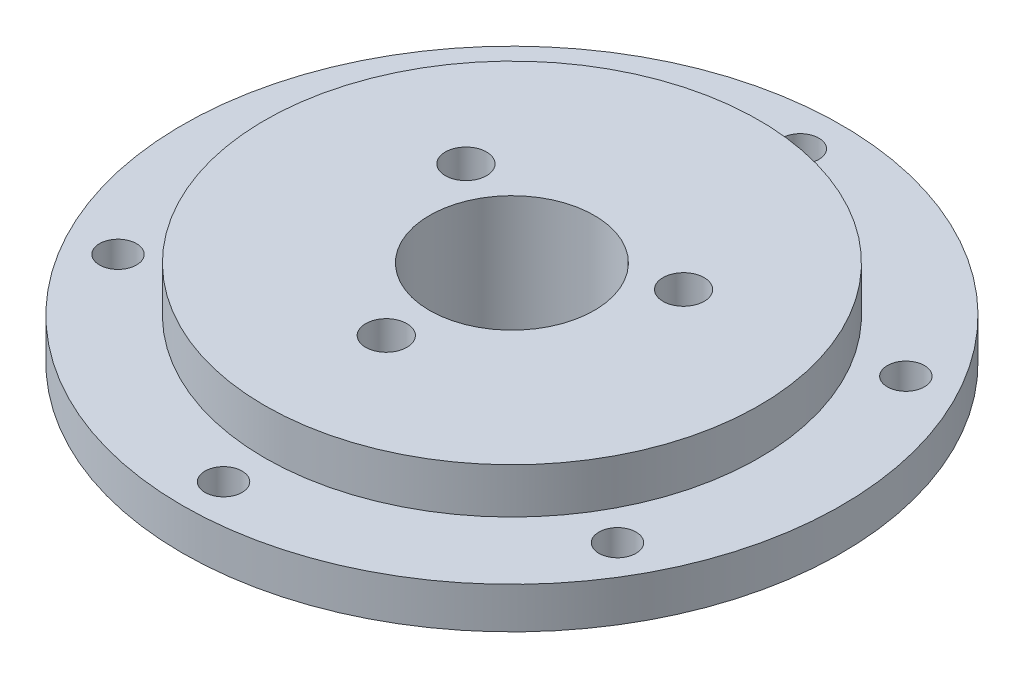
ISO-10303-21;
HEADER;
FILE_DESCRIPTION(('STEP AP214'),'2;1');
FILE_NAME('part.step','',(''),(''),'','','');
FILE_SCHEMA(('AUTOMOTIVE_DESIGN { 1 0 10303 214 1 1 1 1 }'));
ENDSEC;
DATA;
#1=APPLICATION_CONTEXT('core data for automotive mechanical design processes');
#2=APPLICATION_PROTOCOL_DEFINITION('international standard','automotive_design',2000,#1);
#3=PRODUCT_CONTEXT('',#1,'mechanical');
#4=PRODUCT('Part','Part','',(#3));
#5=PRODUCT_RELATED_PRODUCT_CATEGORY('part','',(#4));
#6=PRODUCT_DEFINITION_FORMATION('','',#4);
#7=PRODUCT_DEFINITION_CONTEXT('part definition',#1,'design');
#8=PRODUCT_DEFINITION('design','',#6,#7);
#9=PRODUCT_DEFINITION_SHAPE('','',#8);
#10=(LENGTH_UNIT() NAMED_UNIT(*) SI_UNIT(.MILLI.,.METRE.));
#11=(NAMED_UNIT(*) PLANE_ANGLE_UNIT() SI_UNIT($,.RADIAN.));
#12=(NAMED_UNIT(*) SI_UNIT($,.STERADIAN.) SOLID_ANGLE_UNIT());
#13=UNCERTAINTY_MEASURE_WITH_UNIT(LENGTH_MEASURE(1.E-05),#10,'distance_accuracy_value','');
#14=(GEOMETRIC_REPRESENTATION_CONTEXT(3) GLOBAL_UNCERTAINTY_ASSIGNED_CONTEXT((#13)) GLOBAL_UNIT_ASSIGNED_CONTEXT((#10,
#11,#12)) REPRESENTATION_CONTEXT('',''));
#15=CARTESIAN_POINT('',(0.,0.,0.));
#16=DIRECTION('',(0.,0.,1.));
#17=DIRECTION('',(1.,0.,0.));
#18=AXIS2_PLACEMENT_3D('',#15,#16,#17);
#19=CARTESIAN_POINT('',(0.,5.,0.));
#20=DIRECTION('',(0.,1.,0.));
#21=DIRECTION('',(0.,0.,1.));
#22=AXIS2_PLACEMENT_3D('',#19,#20,#21);
#23=PLANE('',#22);
#24=CARTESIAN_POINT('',(0.,5.,0.));
#25=DIRECTION('',(0.,1.,0.));
#26=DIRECTION('',(0.,0.,1.));
#27=AXIS2_PLACEMENT_3D('',#24,#25,#26);
#28=CIRCLE('',#27,30.);
#29=CARTESIAN_POINT('',(0.,5.,30.));
#30=VERTEX_POINT('',#29);
#31=EDGE_CURVE('E11',#30,#30,#28,.T.);
#32=ORIENTED_EDGE('',*,*,#31,.F.);
#33=EDGE_LOOP('',(#32));
#34=FACE_BOUND('',#33,.T.);
#35=CARTESIAN_POINT('',(-30.3108891324555,5.,17.4999999999997));
#36=DIRECTION('',(0.,1.,0.));
#37=DIRECTION('',(0.,0.,1.));
#38=AXIS2_PLACEMENT_3D('',#35,#36,#37);
#39=CIRCLE('',#38,2.25);
#40=CARTESIAN_POINT('',(-30.3108891324555,5.,19.7499999999997));
#41=VERTEX_POINT('',#40);
#42=EDGE_CURVE('E58',#41,#41,#39,.T.);
#43=ORIENTED_EDGE('',*,*,#42,.F.);
#44=EDGE_LOOP('',(#43));
#45=FACE_BOUND('',#44,.T.);
#46=CARTESIAN_POINT('',(30.3108891324553,5.,17.5000000000001));
#47=DIRECTION('',(0.,1.,0.));
#48=DIRECTION('',(0.,0.,1.));
#49=AXIS2_PLACEMENT_3D('',#46,#47,#48);
#50=CIRCLE('',#49,2.25);
#51=CARTESIAN_POINT('',(30.3108891324553,5.,19.7500000000001));
#52=VERTEX_POINT('',#51);
#53=EDGE_CURVE('E70',#52,#52,#50,.T.);
#54=ORIENTED_EDGE('',*,*,#53,.F.);
#55=EDGE_LOOP('',(#54));
#56=FACE_BOUND('',#55,.T.);
#57=CARTESIAN_POINT('',(0.,5.,-35.));
#58=DIRECTION('',(0.,1.,0.));
#59=DIRECTION('',(0.,0.,1.));
#60=AXIS2_PLACEMENT_3D('',#57,#58,#59);
#61=CIRCLE('',#60,2.25);
#62=CARTESIAN_POINT('',(0.,5.,-32.75));
#63=VERTEX_POINT('',#62);
#64=EDGE_CURVE('E82',#63,#63,#61,.T.);
#65=ORIENTED_EDGE('',*,*,#64,.F.);
#66=EDGE_LOOP('',(#65));
#67=FACE_BOUND('',#66,.T.);
#68=CARTESIAN_POINT('',(0.,5.,0.));
#69=DIRECTION('',(0.,1.,0.));
#70=DIRECTION('',(0.,0.,1.));
#71=AXIS2_PLACEMENT_3D('',#68,#69,#70);
#72=CIRCLE('',#71,40.);
#73=CARTESIAN_POINT('',(0.,5.,40.));
#74=VERTEX_POINT('',#73);
#75=EDGE_CURVE('E40',#74,#74,#72,.T.);
#76=ORIENTED_EDGE('',*,*,#75,.T.);
#77=EDGE_LOOP('',(#76));
#78=FACE_BOUND('',#77,.T.);
#79=CARTESIAN_POINT('',(30.3108891324554,5.,-17.4999999999999));
#80=DIRECTION('',(0.,1.,0.));
#81=DIRECTION('',(0.,0.,1.));
#82=AXIS2_PLACEMENT_3D('',#79,#80,#81);
#83=CIRCLE('',#82,2.25);
#84=CARTESIAN_POINT('',(30.3108891324554,5.,-15.2499999999999));
#85=VERTEX_POINT('',#84);
#86=EDGE_CURVE('E76',#85,#85,#83,.T.);
#87=ORIENTED_EDGE('',*,*,#86,.F.);
#88=EDGE_LOOP('',(#87));
#89=FACE_BOUND('',#88,.T.);
#90=CARTESIAN_POINT('',(-2.44403693719019E-13,5.,35.));
#91=DIRECTION('',(0.,1.,0.));
#92=DIRECTION('',(0.,0.,1.));
#93=AXIS2_PLACEMENT_3D('',#90,#91,#92);
#94=CIRCLE('',#93,2.25);
#95=CARTESIAN_POINT('',(-2.44403693719019E-13,5.,37.25));
#96=VERTEX_POINT('',#95);
#97=EDGE_CURVE('E64',#96,#96,#94,.T.);
#98=ORIENTED_EDGE('',*,*,#97,.F.);
#99=EDGE_LOOP('',(#98));
#100=FACE_BOUND('',#99,.T.);
#101=CARTESIAN_POINT('',(-30.3108891324552,5.,-17.5000000000004));
#102=DIRECTION('',(0.,1.,0.));
#103=DIRECTION('',(0.,0.,1.));
#104=AXIS2_PLACEMENT_3D('',#101,#102,#103);
#105=CIRCLE('',#104,2.25);
#106=CARTESIAN_POINT('',(-30.3108891324552,5.,-15.2500000000004));
#107=VERTEX_POINT('',#106);
#108=EDGE_CURVE('E51',#107,#107,#105,.T.);
#109=ORIENTED_EDGE('',*,*,#108,.F.);
#110=EDGE_LOOP('',(#109));
#111=FACE_BOUND('',#110,.T.);
#112=ADVANCED_FACE('F32',(#34,#45,#56,#67,#78,#89,#100,#111),#23,.T.);
#113=CARTESIAN_POINT('',(0.,0.,0.));
#114=DIRECTION('',(0.,1.,0.));
#115=DIRECTION('',(0.,0.,1.));
#116=AXIS2_PLACEMENT_3D('',#113,#114,#115);
#117=PLANE('',#116);
#118=CARTESIAN_POINT('',(0.,0.,0.));
#119=DIRECTION('',(0.,1.,0.));
#120=DIRECTION('',(0.,0.,1.));
#121=AXIS2_PLACEMENT_3D('',#118,#119,#120);
#122=CIRCLE('',#121,30.);
#123=CARTESIAN_POINT('',(0.,0.,30.));
#124=VERTEX_POINT('',#123);
#125=EDGE_CURVE('E36',#124,#124,#122,.T.);
#126=ORIENTED_EDGE('',*,*,#125,.T.);
#127=EDGE_LOOP('',(#126));
#128=FACE_BOUND('',#127,.T.);
#129=CARTESIAN_POINT('',(0.,0.,0.));
#130=DIRECTION('',(0.,1.,0.));
#131=DIRECTION('',(0.,0.,1.));
#132=AXIS2_PLACEMENT_3D('',#129,#130,#131);
#133=CIRCLE('',#132,40.);
#134=CARTESIAN_POINT('',(0.,0.,40.));
#135=VERTEX_POINT('',#134);
#136=EDGE_CURVE('E45',#135,#135,#133,.T.);
#137=ORIENTED_EDGE('',*,*,#136,.F.);
#138=EDGE_LOOP('',(#137));
#139=FACE_BOUND('',#138,.T.);
#140=CARTESIAN_POINT('',(0.,0.,-35.));
#141=DIRECTION('',(0.,1.,0.));
#142=DIRECTION('',(0.,0.,1.));
#143=AXIS2_PLACEMENT_3D('',#140,#141,#142);
#144=CIRCLE('',#143,2.25);
#145=CARTESIAN_POINT('',(0.,0.,-32.75));
#146=VERTEX_POINT('',#145);
#147=EDGE_CURVE('E79',#146,#146,#144,.T.);
#148=ORIENTED_EDGE('',*,*,#147,.T.);
#149=EDGE_LOOP('',(#148));
#150=FACE_BOUND('',#149,.T.);
#151=CARTESIAN_POINT('',(30.3108891324554,0.,-17.4999999999999));
#152=DIRECTION('',(0.,1.,0.));
#153=DIRECTION('',(0.,0.,1.));
#154=AXIS2_PLACEMENT_3D('',#151,#152,#153);
#155=CIRCLE('',#154,2.25);
#156=CARTESIAN_POINT('',(30.3108891324554,0.,-15.2499999999999));
#157=VERTEX_POINT('',#156);
#158=EDGE_CURVE('E73',#157,#157,#155,.T.);
#159=ORIENTED_EDGE('',*,*,#158,.T.);
#160=EDGE_LOOP('',(#159));
#161=FACE_BOUND('',#160,.T.);
#162=CARTESIAN_POINT('',(30.3108891324553,0.,17.5000000000001));
#163=DIRECTION('',(0.,1.,0.));
#164=DIRECTION('',(0.,0.,1.));
#165=AXIS2_PLACEMENT_3D('',#162,#163,#164);
#166=CIRCLE('',#165,2.25);
#167=CARTESIAN_POINT('',(30.3108891324553,0.,19.7500000000001));
#168=VERTEX_POINT('',#167);
#169=EDGE_CURVE('E67',#168,#168,#166,.T.);
#170=ORIENTED_EDGE('',*,*,#169,.T.);
#171=EDGE_LOOP('',(#170));
#172=FACE_BOUND('',#171,.T.);
#173=CARTESIAN_POINT('',(-2.44403693719019E-13,0.,35.));
#174=DIRECTION('',(0.,1.,0.));
#175=DIRECTION('',(0.,0.,1.));
#176=AXIS2_PLACEMENT_3D('',#173,#174,#175);
#177=CIRCLE('',#176,2.25);
#178=CARTESIAN_POINT('',(-2.44403693719019E-13,0.,37.25));
#179=VERTEX_POINT('',#178);
#180=EDGE_CURVE('E61',#179,#179,#177,.T.);
#181=ORIENTED_EDGE('',*,*,#180,.T.);
#182=EDGE_LOOP('',(#181));
#183=FACE_BOUND('',#182,.T.);
#184=CARTESIAN_POINT('',(-30.3108891324555,0.,17.4999999999997));
#185=DIRECTION('',(0.,1.,0.));
#186=DIRECTION('',(0.,0.,1.));
#187=AXIS2_PLACEMENT_3D('',#184,#185,#186);
#188=CIRCLE('',#187,2.25);
#189=CARTESIAN_POINT('',(-30.3108891324555,0.,19.7499999999997));
#190=VERTEX_POINT('',#189);
#191=EDGE_CURVE('E54',#190,#190,#188,.T.);
#192=ORIENTED_EDGE('',*,*,#191,.T.);
#193=EDGE_LOOP('',(#192));
#194=FACE_BOUND('',#193,.T.);
#195=CARTESIAN_POINT('',(-30.3108891324552,0.,-17.5000000000004));
#196=DIRECTION('',(0.,1.,0.));
#197=DIRECTION('',(0.,0.,1.));
#198=AXIS2_PLACEMENT_3D('',#195,#196,#197);
#199=CIRCLE('',#198,2.25);
#200=CARTESIAN_POINT('',(-30.3108891324552,0.,-15.2500000000004));
#201=VERTEX_POINT('',#200);
#202=EDGE_CURVE('E55',#201,#201,#199,.T.);
#203=ORIENTED_EDGE('',*,*,#202,.T.);
#204=EDGE_LOOP('',(#203));
#205=FACE_BOUND('',#204,.T.);
#206=ADVANCED_FACE('F90',(#128,#139,#150,#161,#172,#183,#194,#205),#117,.F.);
#207=CARTESIAN_POINT('',(0.,5.,0.));
#208=DIRECTION('',(0.,-1.,0.));
#209=DIRECTION('',(0.,0.,-1.));
#210=AXIS2_PLACEMENT_3D('',#207,#208,#209);
#211=CYLINDRICAL_SURFACE('',#210,40.);
#212=ORIENTED_EDGE('',*,*,#75,.F.);
#213=EDGE_LOOP('',(#212));
#214=FACE_BOUND('',#213,.T.);
#215=ORIENTED_EDGE('',*,*,#136,.T.);
#216=EDGE_LOOP('',(#215));
#217=FACE_BOUND('',#216,.T.);
#218=ADVANCED_FACE('F34',(#214,#217),#211,.T.);
#219=CARTESIAN_POINT('',(0.,5.,-35.));
#220=DIRECTION('',(0.,-1.,0.));
#221=DIRECTION('',(0.,0.,-1.));
#222=AXIS2_PLACEMENT_3D('',#219,#220,#221);
#223=CYLINDRICAL_SURFACE('',#222,2.25);
#224=ORIENTED_EDGE('',*,*,#64,.T.);
#225=EDGE_LOOP('',(#224));
#226=FACE_BOUND('',#225,.T.);
#227=ORIENTED_EDGE('',*,*,#147,.F.);
#228=EDGE_LOOP('',(#227));
#229=FACE_BOUND('',#228,.T.);
#230=ADVANCED_FACE('F130',(#226,#229),#223,.F.);
#231=CARTESIAN_POINT('',(30.3108891324554,5.,-17.4999999999999));
#232=DIRECTION('',(0.,-1.,0.));
#233=DIRECTION('',(0.,0.,-1.));
#234=AXIS2_PLACEMENT_3D('',#231,#232,#233);
#235=CYLINDRICAL_SURFACE('',#234,2.25);
#236=ORIENTED_EDGE('',*,*,#86,.T.);
#237=EDGE_LOOP('',(#236));
#238=FACE_BOUND('',#237,.T.);
#239=ORIENTED_EDGE('',*,*,#158,.F.);
#240=EDGE_LOOP('',(#239));
#241=FACE_BOUND('',#240,.T.);
#242=ADVANCED_FACE('F133',(#238,#241),#235,.F.);
#243=CARTESIAN_POINT('',(30.3108891324553,5.,17.5000000000001));
#244=DIRECTION('',(0.,-1.,0.));
#245=DIRECTION('',(0.,0.,-1.));
#246=AXIS2_PLACEMENT_3D('',#243,#244,#245);
#247=CYLINDRICAL_SURFACE('',#246,2.25);
#248=ORIENTED_EDGE('',*,*,#53,.T.);
#249=EDGE_LOOP('',(#248));
#250=FACE_BOUND('',#249,.T.);
#251=ORIENTED_EDGE('',*,*,#169,.F.);
#252=EDGE_LOOP('',(#251));
#253=FACE_BOUND('',#252,.T.);
#254=ADVANCED_FACE('F137',(#250,#253),#247,.F.);
#255=CARTESIAN_POINT('',(-2.44403693719019E-13,5.,35.));
#256=DIRECTION('',(0.,-1.,0.));
#257=DIRECTION('',(0.,0.,-1.));
#258=AXIS2_PLACEMENT_3D('',#255,#256,#257);
#259=CYLINDRICAL_SURFACE('',#258,2.25);
#260=ORIENTED_EDGE('',*,*,#97,.T.);
#261=EDGE_LOOP('',(#260));
#262=FACE_BOUND('',#261,.T.);
#263=ORIENTED_EDGE('',*,*,#180,.F.);
#264=EDGE_LOOP('',(#263));
#265=FACE_BOUND('',#264,.T.);
#266=ADVANCED_FACE('F119',(#262,#265),#259,.F.);
#267=CARTESIAN_POINT('',(-30.3108891324555,5.,17.4999999999997));
#268=DIRECTION('',(0.,-1.,0.));
#269=DIRECTION('',(0.,0.,-1.));
#270=AXIS2_PLACEMENT_3D('',#267,#268,#269);
#271=CYLINDRICAL_SURFACE('',#270,2.25);
#272=ORIENTED_EDGE('',*,*,#42,.T.);
#273=EDGE_LOOP('',(#272));
#274=FACE_BOUND('',#273,.T.);
#275=ORIENTED_EDGE('',*,*,#191,.F.);
#276=EDGE_LOOP('',(#275));
#277=FACE_BOUND('',#276,.T.);
#278=ADVANCED_FACE('F109',(#274,#277),#271,.F.);
#279=CARTESIAN_POINT('',(-30.3108891324552,5.,-17.5000000000004));
#280=DIRECTION('',(0.,-1.,0.));
#281=DIRECTION('',(0.,0.,-1.));
#282=AXIS2_PLACEMENT_3D('',#279,#280,#281);
#283=CYLINDRICAL_SURFACE('',#282,2.25);
#284=ORIENTED_EDGE('',*,*,#108,.T.);
#285=EDGE_LOOP('',(#284));
#286=FACE_BOUND('',#285,.T.);
#287=ORIENTED_EDGE('',*,*,#202,.F.);
#288=EDGE_LOOP('',(#287));
#289=FACE_BOUND('',#288,.T.);
#290=ADVANCED_FACE('F106',(#286,#289),#283,.F.);
#291=CARTESIAN_POINT('',(0.,-95.8528137423857,0.));
#292=DIRECTION('',(0.,1.,0.));
#293=DIRECTION('',(0.,0.,1.));
#294=AXIS2_PLACEMENT_3D('',#291,#292,#293);
#295=CYLINDRICAL_SURFACE('',#294,10.);
#296=CARTESIAN_POINT('',(0.,-5.50000000000001,0.));
#297=DIRECTION('',(0.,1.,0.));
#298=DIRECTION('',(0.,0.,1.));
#299=AXIS2_PLACEMENT_3D('',#296,#297,#298);
#300=CIRCLE('',#299,10.);
#301=CARTESIAN_POINT('',(0.,-5.50000000000001,10.));
#302=VERTEX_POINT('',#301);
#303=EDGE_CURVE('E280',#302,#302,#300,.F.);
#304=ORIENTED_EDGE('',*,*,#303,.T.);
#305=EDGE_LOOP('',(#304));
#306=FACE_BOUND('',#305,.T.);
#307=CARTESIAN_POINT('',(0.,10.5,0.));
#308=DIRECTION('',(0.,1.,0.));
#309=DIRECTION('',(0.,0.,1.));
#310=AXIS2_PLACEMENT_3D('',#307,#308,#309);
#311=CIRCLE('',#310,10.);
#312=CARTESIAN_POINT('',(0.,10.5,10.));
#313=VERTEX_POINT('',#312);
#314=EDGE_CURVE('E270',#313,#313,#311,.T.);
#315=ORIENTED_EDGE('',*,*,#314,.T.);
#316=EDGE_LOOP('',(#315));
#317=FACE_BOUND('',#316,.T.);
#318=ADVANCED_FACE('F108',(#306,#317),#295,.F.);
#319=CARTESIAN_POINT('',(-13.2068874077127,-95.8528137423857,-7.625));
#320=DIRECTION('',(0.,1.,0.));
#321=DIRECTION('',(0.,0.,1.));
#322=AXIS2_PLACEMENT_3D('',#319,#320,#321);
#323=CYLINDRICAL_SURFACE('',#322,2.5);
#324=CARTESIAN_POINT('',(-13.2068874077127,-5.50000000000001,-7.625));
#325=DIRECTION('',(0.,1.,0.));
#326=DIRECTION('',(0.,0.,1.));
#327=AXIS2_PLACEMENT_3D('',#324,#325,#326);
#328=CIRCLE('',#327,2.5);
#329=CARTESIAN_POINT('',(-13.2068874077127,-5.50000000000001,-5.125));
#330=VERTEX_POINT('',#329);
#331=EDGE_CURVE('E277',#330,#330,#328,.F.);
#332=ORIENTED_EDGE('',*,*,#331,.T.);
#333=EDGE_LOOP('',(#332));
#334=FACE_BOUND('',#333,.T.);
#335=CARTESIAN_POINT('',(-13.2068874077127,10.5,-7.625));
#336=DIRECTION('',(0.,1.,0.));
#337=DIRECTION('',(0.,0.,1.));
#338=AXIS2_PLACEMENT_3D('',#335,#336,#337);
#339=CIRCLE('',#338,2.5);
#340=CARTESIAN_POINT('',(-13.2068874077127,10.5,-5.125));
#341=VERTEX_POINT('',#340);
#342=EDGE_CURVE('E262',#341,#341,#339,.T.);
#343=ORIENTED_EDGE('',*,*,#342,.T.);
#344=EDGE_LOOP('',(#343));
#345=FACE_BOUND('',#344,.T.);
#346=ADVANCED_FACE('F116',(#334,#345),#323,.F.);
#347=CARTESIAN_POINT('',(0.,-95.8528137423857,15.25));
#348=DIRECTION('',(0.,1.,0.));
#349=DIRECTION('',(0.,0.,1.));
#350=AXIS2_PLACEMENT_3D('',#347,#348,#349);
#351=CYLINDRICAL_SURFACE('',#350,2.5);
#352=CARTESIAN_POINT('',(0.,-5.50000000000001,15.25));
#353=DIRECTION('',(0.,1.,0.));
#354=DIRECTION('',(0.,0.,1.));
#355=AXIS2_PLACEMENT_3D('',#352,#353,#354);
#356=CIRCLE('',#355,2.5);
#357=CARTESIAN_POINT('',(0.,-5.50000000000001,17.75));
#358=VERTEX_POINT('',#357);
#359=EDGE_CURVE('E281',#358,#358,#356,.F.);
#360=ORIENTED_EDGE('',*,*,#359,.T.);
#361=EDGE_LOOP('',(#360));
#362=FACE_BOUND('',#361,.T.);
#363=CARTESIAN_POINT('',(0.,10.5,15.25));
#364=DIRECTION('',(0.,1.,0.));
#365=DIRECTION('',(0.,0.,1.));
#366=AXIS2_PLACEMENT_3D('',#363,#364,#365);
#367=CIRCLE('',#366,2.5);
#368=CARTESIAN_POINT('',(0.,10.5,17.75));
#369=VERTEX_POINT('',#368);
#370=EDGE_CURVE('E265',#369,#369,#367,.T.);
#371=ORIENTED_EDGE('',*,*,#370,.T.);
#372=EDGE_LOOP('',(#371));
#373=FACE_BOUND('',#372,.T.);
#374=ADVANCED_FACE('F185',(#362,#373),#351,.F.);
#375=CARTESIAN_POINT('',(0.,-95.8528137423857,0.));
#376=DIRECTION('',(0.,1.,0.));
#377=DIRECTION('',(0.,0.,1.));
#378=AXIS2_PLACEMENT_3D('',#375,#376,#377);
#379=CYLINDRICAL_SURFACE('',#378,30.);
#380=CARTESIAN_POINT('',(0.,-5.50000000000001,0.));
#381=DIRECTION('',(0.,1.,0.));
#382=DIRECTION('',(0.,0.,1.));
#383=AXIS2_PLACEMENT_3D('',#380,#381,#382);
#384=CIRCLE('',#383,30.);
#385=CARTESIAN_POINT('',(0.,-5.50000000000001,30.));
#386=VERTEX_POINT('',#385);
#387=EDGE_CURVE('E276',#386,#386,#384,.F.);
#388=ORIENTED_EDGE('',*,*,#387,.F.);
#389=EDGE_LOOP('',(#388));
#390=FACE_BOUND('',#389,.T.);
#391=ORIENTED_EDGE('',*,*,#125,.F.);
#392=EDGE_LOOP('',(#391));
#393=FACE_BOUND('',#392,.T.);
#394=ADVANCED_FACE('F179',(#390,#393),#379,.T.);
#395=CARTESIAN_POINT('',(0.,-5.5,0.));
#396=DIRECTION('',(0.,1.,0.));
#397=DIRECTION('',(0.,0.,1.));
#398=AXIS2_PLACEMENT_3D('',#395,#396,#397);
#399=PLANE('',#398);
#400=ORIENTED_EDGE('',*,*,#387,.T.);
#401=EDGE_LOOP('',(#400));
#402=FACE_BOUND('',#401,.T.);
#403=ORIENTED_EDGE('',*,*,#359,.F.);
#404=EDGE_LOOP('',(#403));
#405=FACE_BOUND('',#404,.T.);
#406=CARTESIAN_POINT('',(13.2068874077127,-5.50000000000001,-7.62500000000001));
#407=DIRECTION('',(0.,1.,0.));
#408=DIRECTION('',(0.,0.,1.));
#409=AXIS2_PLACEMENT_3D('',#406,#407,#408);
#410=CIRCLE('',#409,2.5);
#411=CARTESIAN_POINT('',(13.2068874077127,-5.50000000000001,-5.125));
#412=VERTEX_POINT('',#411);
#413=EDGE_CURVE('E49',#412,#412,#410,.F.);
#414=ORIENTED_EDGE('',*,*,#413,.F.);
#415=EDGE_LOOP('',(#414));
#416=FACE_BOUND('',#415,.T.);
#417=ORIENTED_EDGE('',*,*,#331,.F.);
#418=EDGE_LOOP('',(#417));
#419=FACE_BOUND('',#418,.T.);
#420=ORIENTED_EDGE('',*,*,#303,.F.);
#421=EDGE_LOOP('',(#420));
#422=FACE_BOUND('',#421,.T.);
#423=ADVANCED_FACE('F184',(#402,#405,#416,#419,#422),#399,.F.);
#424=CARTESIAN_POINT('',(13.2068874077127,-95.8528137423857,-7.62500000000001));
#425=DIRECTION('',(0.,1.,0.));
#426=DIRECTION('',(0.,0.,1.));
#427=AXIS2_PLACEMENT_3D('',#424,#425,#426);
#428=CYLINDRICAL_SURFACE('',#427,2.5);
#429=ORIENTED_EDGE('',*,*,#413,.T.);
#430=EDGE_LOOP('',(#429));
#431=FACE_BOUND('',#430,.T.);
#432=CARTESIAN_POINT('',(13.2068874077127,10.5,-7.62500000000001));
#433=DIRECTION('',(0.,1.,0.));
#434=DIRECTION('',(0.,0.,1.));
#435=AXIS2_PLACEMENT_3D('',#432,#433,#434);
#436=CIRCLE('',#435,2.5);
#437=CARTESIAN_POINT('',(13.2068874077127,10.5,-5.125));
#438=VERTEX_POINT('',#437);
#439=EDGE_CURVE('E260',#438,#438,#436,.T.);
#440=ORIENTED_EDGE('',*,*,#439,.T.);
#441=EDGE_LOOP('',(#440));
#442=FACE_BOUND('',#441,.T.);
#443=ADVANCED_FACE('F197',(#431,#442),#428,.F.);
#444=ORIENTED_EDGE('',*,*,#31,.T.);
#445=EDGE_LOOP('',(#444));
#446=FACE_BOUND('',#445,.T.);
#447=CARTESIAN_POINT('',(0.,10.5,0.));
#448=DIRECTION('',(0.,1.,0.));
#449=DIRECTION('',(0.,0.,1.));
#450=AXIS2_PLACEMENT_3D('',#447,#448,#449);
#451=CIRCLE('',#450,30.);
#452=CARTESIAN_POINT('',(0.,10.5,30.));
#453=VERTEX_POINT('',#452);
#454=EDGE_CURVE('E273',#453,#453,#451,.T.);
#455=ORIENTED_EDGE('',*,*,#454,.F.);
#456=EDGE_LOOP('',(#455));
#457=FACE_BOUND('',#456,.T.);
#458=ADVANCED_FACE('F187',(#446,#457),#379,.T.);
#459=CARTESIAN_POINT('',(0.,10.5,0.));
#460=DIRECTION('',(0.,1.,0.));
#461=DIRECTION('',(0.,0.,1.));
#462=AXIS2_PLACEMENT_3D('',#459,#460,#461);
#463=PLANE('',#462);
#464=ORIENTED_EDGE('',*,*,#342,.F.);
#465=EDGE_LOOP('',(#464));
#466=FACE_BOUND('',#465,.T.);
#467=ORIENTED_EDGE('',*,*,#314,.F.);
#468=EDGE_LOOP('',(#467));
#469=FACE_BOUND('',#468,.T.);
#470=ORIENTED_EDGE('',*,*,#454,.T.);
#471=EDGE_LOOP('',(#470));
#472=FACE_BOUND('',#471,.T.);
#473=ORIENTED_EDGE('',*,*,#370,.F.);
#474=EDGE_LOOP('',(#473));
#475=FACE_BOUND('',#474,.T.);
#476=ORIENTED_EDGE('',*,*,#439,.F.);
#477=EDGE_LOOP('',(#476));
#478=FACE_BOUND('',#477,.T.);
#479=ADVANCED_FACE('F209',(#466,#469,#472,#475,#478),#463,.T.);
#480=CLOSED_SHELL('',(#112,#206,#218,#230,#242,#254,#266,#278,#290,#318,#346,#374,#394,#423,
#443,#458,#479));
#481=MANIFOLD_SOLID_BREP('B2',#480);
#482=ADVANCED_BREP_SHAPE_REPRESENTATION('',(#18,#481),#14);
#483=SHAPE_DEFINITION_REPRESENTATION(#9,#482);
ENDSEC;
END-ISO-10303-21;
